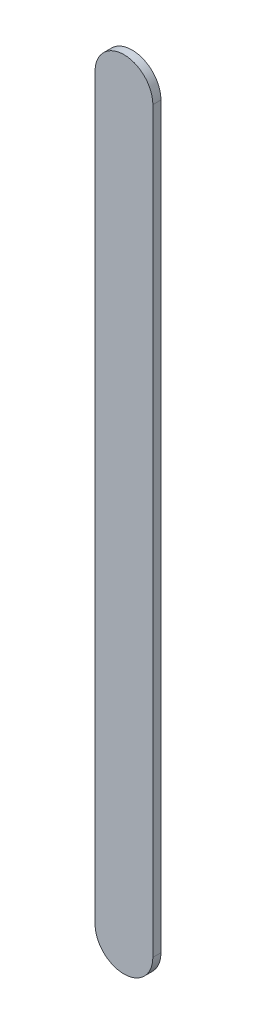
ISO-10303-21;
HEADER;
FILE_DESCRIPTION(('STEP AP214'),'2;1');
FILE_NAME('part.step','',(''),(''),'','','');
FILE_SCHEMA(('AUTOMOTIVE_DESIGN { 1 0 10303 214 1 1 1 1 }'));
ENDSEC;
DATA;
#1=APPLICATION_CONTEXT('core data for automotive mechanical design processes');
#2=APPLICATION_PROTOCOL_DEFINITION('international standard','automotive_design',2000,#1);
#3=PRODUCT_CONTEXT('',#1,'mechanical');
#4=PRODUCT('Part','Part','',(#3));
#5=PRODUCT_RELATED_PRODUCT_CATEGORY('part','',(#4));
#6=PRODUCT_DEFINITION_FORMATION('','',#4);
#7=PRODUCT_DEFINITION_CONTEXT('part definition',#1,'design');
#8=PRODUCT_DEFINITION('design','',#6,#7);
#9=PRODUCT_DEFINITION_SHAPE('','',#8);
#10=(LENGTH_UNIT() NAMED_UNIT(*) SI_UNIT(.MILLI.,.METRE.));
#11=(NAMED_UNIT(*) PLANE_ANGLE_UNIT() SI_UNIT($,.RADIAN.));
#12=(NAMED_UNIT(*) SI_UNIT($,.STERADIAN.) SOLID_ANGLE_UNIT());
#13=UNCERTAINTY_MEASURE_WITH_UNIT(LENGTH_MEASURE(1.E-05),#10,'distance_accuracy_value','');
#14=(GEOMETRIC_REPRESENTATION_CONTEXT(3) GLOBAL_UNCERTAINTY_ASSIGNED_CONTEXT((#13)) GLOBAL_UNIT_ASSIGNED_CONTEXT((#10,
#11,#12)) REPRESENTATION_CONTEXT('',''));
#15=CARTESIAN_POINT('',(0.,0.,0.));
#16=DIRECTION('',(0.,0.,1.));
#17=DIRECTION('',(1.,0.,0.));
#18=AXIS2_PLACEMENT_3D('',#15,#16,#17);
#19=CARTESIAN_POINT('',(76.93697084,77.29397546,0.));
#20=DIRECTION('',(-1.,0.,0.));
#21=DIRECTION('',(0.,1.,0.));
#22=AXIS2_PLACEMENT_3D('',#19,#20,#21);
#23=PLANE('',#22);
#24=DIRECTION('',(0.,1.,0.));
#25=VECTOR('',#24,1.);
#26=CARTESIAN_POINT('',(76.93697084,77.29397546,0.03556));
#27=LINE('',#26,#25);
#28=CARTESIAN_POINT('',(76.93697084,77.29397546,0.03556));
#29=VERTEX_POINT('',#28);
#30=CARTESIAN_POINT('',(76.93697084,80.53996084,0.03556));
#31=VERTEX_POINT('',#30);
#32=EDGE_CURVE('E11',#29,#31,#27,.T.);
#33=ORIENTED_EDGE('',*,*,#32,.F.);
#34=DIRECTION('',(0.,0.,1.));
#35=VECTOR('',#34,1.);
#36=CARTESIAN_POINT('',(76.93697084,77.29397546,0.));
#37=LINE('',#36,#35);
#38=CARTESIAN_POINT('',(76.93697084,77.29397546,0.));
#39=VERTEX_POINT('',#38);
#40=EDGE_CURVE('E24',#39,#29,#37,.T.);
#41=ORIENTED_EDGE('',*,*,#40,.F.);
#42=DIRECTION('',(0.,1.,0.));
#43=VECTOR('',#42,1.);
#44=CARTESIAN_POINT('',(76.93697084,77.29397546,0.));
#45=LINE('',#44,#43);
#46=CARTESIAN_POINT('',(76.93697084,80.53996084,0.));
#47=VERTEX_POINT('',#46);
#48=EDGE_CURVE('E75',#39,#47,#45,.T.);
#49=ORIENTED_EDGE('',*,*,#48,.T.);
#50=DIRECTION('',(0.,0.,1.));
#51=VECTOR('',#50,1.);
#52=CARTESIAN_POINT('',(76.93697084,80.53996084,0.));
#53=LINE('',#52,#51);
#54=EDGE_CURVE('E37',#47,#31,#53,.T.);
#55=ORIENTED_EDGE('',*,*,#54,.T.);
#56=EDGE_LOOP('',(#33,#41,#49,#55));
#57=FACE_BOUND('',#56,.T.);
#58=ADVANCED_FACE('F17',(#57),#23,.F.);
#59=CARTESIAN_POINT('',(76.80997084,80.53996084,0.));
#60=DIRECTION('',(0.,0.,-1.));
#61=DIRECTION('',(1.,0.,0.));
#62=AXIS2_PLACEMENT_3D('',#59,#60,#61);
#63=CYLINDRICAL_SURFACE('',#62,0.127);
#64=CARTESIAN_POINT('',(76.80997084,80.53996084,0.03556));
#65=DIRECTION('',(0.,0.,1.));
#66=DIRECTION('',(1.,0.,0.));
#67=AXIS2_PLACEMENT_3D('',#64,#65,#66);
#68=CIRCLE('',#67,0.127);
#69=CARTESIAN_POINT('',(76.68297084,80.53996084,0.03556));
#70=VERTEX_POINT('',#69);
#71=EDGE_CURVE('E83',#31,#70,#68,.T.);
#72=ORIENTED_EDGE('',*,*,#71,.F.);
#73=ORIENTED_EDGE('',*,*,#54,.F.);
#74=CARTESIAN_POINT('',(76.80997084,80.53996084,0.));
#75=DIRECTION('',(0.,0.,1.));
#76=DIRECTION('',(1.,0.,0.));
#77=AXIS2_PLACEMENT_3D('',#74,#75,#76);
#78=CIRCLE('',#77,0.127);
#79=CARTESIAN_POINT('',(76.68297084,80.53996084,0.));
#80=VERTEX_POINT('',#79);
#81=EDGE_CURVE('E81',#47,#80,#78,.T.);
#82=ORIENTED_EDGE('',*,*,#81,.T.);
#83=DIRECTION('',(0.,0.,1.));
#84=VECTOR('',#83,1.);
#85=CARTESIAN_POINT('',(76.68297084,80.53996084,0.));
#86=LINE('',#85,#84);
#87=EDGE_CURVE('E67',#80,#70,#86,.T.);
#88=ORIENTED_EDGE('',*,*,#87,.T.);
#89=EDGE_LOOP('',(#72,#73,#82,#88));
#90=FACE_BOUND('',#89,.T.);
#91=ADVANCED_FACE('F89',(#90),#63,.T.);
#92=CARTESIAN_POINT('',(76.68297084,80.53996084,0.));
#93=DIRECTION('',(1.,0.,0.));
#94=DIRECTION('',(0.,-1.,0.));
#95=AXIS2_PLACEMENT_3D('',#92,#93,#94);
#96=PLANE('',#95);
#97=DIRECTION('',(0.,-1.,0.));
#98=VECTOR('',#97,1.);
#99=CARTESIAN_POINT('',(76.68297084,80.53996084,0.03556));
#100=LINE('',#99,#98);
#101=CARTESIAN_POINT('',(76.68297084,77.29397546,0.03556));
#102=VERTEX_POINT('',#101);
#103=EDGE_CURVE('E71',#70,#102,#100,.T.);
#104=ORIENTED_EDGE('',*,*,#103,.F.);
#105=ORIENTED_EDGE('',*,*,#87,.F.);
#106=DIRECTION('',(0.,-1.,0.));
#107=VECTOR('',#106,1.);
#108=CARTESIAN_POINT('',(76.68297084,80.53996084,0.));
#109=LINE('',#108,#107);
#110=CARTESIAN_POINT('',(76.68297084,77.29397546,0.));
#111=VERTEX_POINT('',#110);
#112=EDGE_CURVE('E63',#80,#111,#109,.T.);
#113=ORIENTED_EDGE('',*,*,#112,.T.);
#114=DIRECTION('',(0.,0.,1.));
#115=VECTOR('',#114,1.);
#116=CARTESIAN_POINT('',(76.68297084,77.29397546,0.));
#117=LINE('',#116,#115);
#118=EDGE_CURVE('E53',#111,#102,#117,.T.);
#119=ORIENTED_EDGE('',*,*,#118,.T.);
#120=EDGE_LOOP('',(#104,#105,#113,#119));
#121=FACE_BOUND('',#120,.T.);
#122=ADVANCED_FACE('F66',(#121),#96,.F.);
#123=CARTESIAN_POINT('',(76.80997084,77.29397546,0.));
#124=DIRECTION('',(0.,0.,-1.));
#125=DIRECTION('',(-1.,-1.1189649382048E-13,0.));
#126=AXIS2_PLACEMENT_3D('',#123,#124,#125);
#127=CYLINDRICAL_SURFACE('',#126,0.127000000000005);
#128=CARTESIAN_POINT('',(76.80997084,77.29397546,0.03556));
#129=DIRECTION('',(0.,0.,1.));
#130=DIRECTION('',(-1.,-1.1189649382048E-13,0.));
#131=AXIS2_PLACEMENT_3D('',#128,#129,#130);
#132=CIRCLE('',#131,0.127000000000005);
#133=EDGE_CURVE('E59',#102,#29,#132,.T.);
#134=ORIENTED_EDGE('',*,*,#133,.F.);
#135=ORIENTED_EDGE('',*,*,#118,.F.);
#136=CARTESIAN_POINT('',(76.80997084,77.29397546,0.));
#137=DIRECTION('',(0.,0.,1.));
#138=DIRECTION('',(-1.,-1.1189649382048E-13,0.));
#139=AXIS2_PLACEMENT_3D('',#136,#137,#138);
#140=CIRCLE('',#139,0.127000000000005);
#141=EDGE_CURVE('E57',#111,#39,#140,.T.);
#142=ORIENTED_EDGE('',*,*,#141,.T.);
#143=ORIENTED_EDGE('',*,*,#40,.T.);
#144=EDGE_LOOP('',(#134,#135,#142,#143));
#145=FACE_BOUND('',#144,.T.);
#146=ADVANCED_FACE('F55',(#145),#127,.T.);
#147=CARTESIAN_POINT('',(76.93697084,77.29397546,0.));
#148=DIRECTION('',(0.,0.,-1.));
#149=DIRECTION('',(-1.,0.,0.));
#150=AXIS2_PLACEMENT_3D('',#147,#148,#149);
#151=PLANE('',#150);
#152=ORIENTED_EDGE('',*,*,#141,.F.);
#153=ORIENTED_EDGE('',*,*,#112,.F.);
#154=ORIENTED_EDGE('',*,*,#81,.F.);
#155=ORIENTED_EDGE('',*,*,#48,.F.);
#156=EDGE_LOOP('',(#152,#153,#154,#155));
#157=FACE_BOUND('',#156,.T.);
#158=ADVANCED_FACE('F74',(#157),#151,.T.);
#159=CARTESIAN_POINT('',(76.93697084,77.29397546,0.03556));
#160=DIRECTION('',(0.,0.,-1.));
#161=DIRECTION('',(-1.,0.,0.));
#162=AXIS2_PLACEMENT_3D('',#159,#160,#161);
#163=PLANE('',#162);
#164=ORIENTED_EDGE('',*,*,#32,.T.);
#165=ORIENTED_EDGE('',*,*,#71,.T.);
#166=ORIENTED_EDGE('',*,*,#103,.T.);
#167=ORIENTED_EDGE('',*,*,#133,.T.);
#168=EDGE_LOOP('',(#164,#165,#166,#167));
#169=FACE_BOUND('',#168,.T.);
#170=ADVANCED_FACE('F91',(#169),#163,.F.);
#171=CLOSED_SHELL('',(#58,#91,#122,#146,#158,#170));
#172=MANIFOLD_SOLID_BREP('B1',#171);
#173=ADVANCED_BREP_SHAPE_REPRESENTATION('',(#18,#172),#14);
#174=SHAPE_DEFINITION_REPRESENTATION(#9,#173);
ENDSEC;
END-ISO-10303-21;
